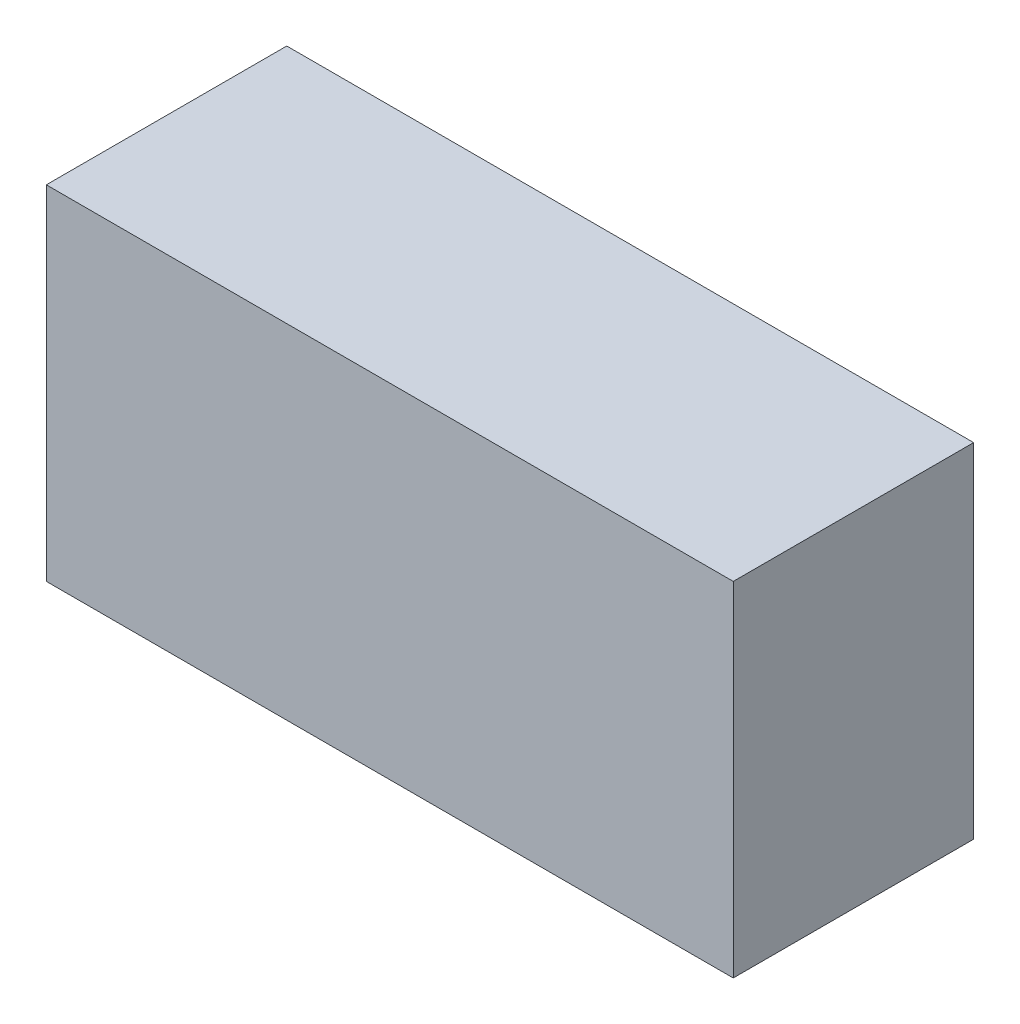
ISO-10303-21;
HEADER;
FILE_DESCRIPTION(('STEP AP214'),'2;1');
FILE_NAME('part.step','',(''),(''),'','','');
FILE_SCHEMA(('AUTOMOTIVE_DESIGN { 1 0 10303 214 1 1 1 1 }'));
ENDSEC;
DATA;
#1=APPLICATION_CONTEXT('core data for automotive mechanical design processes');
#2=APPLICATION_PROTOCOL_DEFINITION('international standard','automotive_design',2000,#1);
#3=PRODUCT_CONTEXT('',#1,'mechanical');
#4=PRODUCT('Part','Part','',(#3));
#5=PRODUCT_RELATED_PRODUCT_CATEGORY('part','',(#4));
#6=PRODUCT_DEFINITION_FORMATION('','',#4);
#7=PRODUCT_DEFINITION_CONTEXT('part definition',#1,'design');
#8=PRODUCT_DEFINITION('design','',#6,#7);
#9=PRODUCT_DEFINITION_SHAPE('','',#8);
#10=(LENGTH_UNIT() NAMED_UNIT(*) SI_UNIT(.MILLI.,.METRE.));
#11=(NAMED_UNIT(*) PLANE_ANGLE_UNIT() SI_UNIT($,.RADIAN.));
#12=(NAMED_UNIT(*) SI_UNIT($,.STERADIAN.) SOLID_ANGLE_UNIT());
#13=UNCERTAINTY_MEASURE_WITH_UNIT(LENGTH_MEASURE(1.E-05),#10,'distance_accuracy_value','');
#14=(GEOMETRIC_REPRESENTATION_CONTEXT(3) GLOBAL_UNCERTAINTY_ASSIGNED_CONTEXT((#13)) GLOBAL_UNIT_ASSIGNED_CONTEXT((#10,
#11,#12)) REPRESENTATION_CONTEXT('',''));
#15=CARTESIAN_POINT('',(0.,0.,0.));
#16=DIRECTION('',(0.,0.,1.));
#17=DIRECTION('',(1.,0.,0.));
#18=AXIS2_PLACEMENT_3D('',#15,#16,#17);
#19=CARTESIAN_POINT('',(-500.,500.,175.));
#20=DIRECTION('',(0.,0.,-1.));
#21=DIRECTION('',(-1.,0.,0.));
#22=AXIS2_PLACEMENT_3D('',#19,#20,#21);
#23=PLANE('',#22);
#24=DIRECTION('',(1.,0.,0.));
#25=VECTOR('',#24,1.);
#26=CARTESIAN_POINT('',(-500.,0.,175.));
#27=LINE('',#26,#25);
#28=CARTESIAN_POINT('',(-500.,0.,175.));
#29=VERTEX_POINT('',#28);
#30=CARTESIAN_POINT('',(500.,0.,175.));
#31=VERTEX_POINT('',#30);
#32=EDGE_CURVE('E95',#29,#31,#27,.T.);
#33=ORIENTED_EDGE('',*,*,#32,.T.);
#34=DIRECTION('',(0.,-1.,0.));
#35=VECTOR('',#34,1.);
#36=CARTESIAN_POINT('',(500.,500.,175.));
#37=LINE('',#36,#35);
#38=CARTESIAN_POINT('',(500.,500.,175.));
#39=VERTEX_POINT('',#38);
#40=EDGE_CURVE('E11',#39,#31,#37,.T.);
#41=ORIENTED_EDGE('',*,*,#40,.F.);
#42=DIRECTION('',(1.,0.,0.));
#43=VECTOR('',#42,1.);
#44=CARTESIAN_POINT('',(-500.,500.,175.));
#45=LINE('',#44,#43);
#46=CARTESIAN_POINT('',(-500.,500.,175.));
#47=VERTEX_POINT('',#46);
#48=EDGE_CURVE('E72',#47,#39,#45,.T.);
#49=ORIENTED_EDGE('',*,*,#48,.F.);
#50=DIRECTION('',(0.,-1.,0.));
#51=VECTOR('',#50,1.);
#52=CARTESIAN_POINT('',(-500.,500.,175.));
#53=LINE('',#52,#51);
#54=EDGE_CURVE('E91',#47,#29,#53,.T.);
#55=ORIENTED_EDGE('',*,*,#54,.T.);
#56=EDGE_LOOP('',(#33,#41,#49,#55));
#57=FACE_BOUND('',#56,.T.);
#58=ADVANCED_FACE('F33',(#57),#23,.F.);
#59=CARTESIAN_POINT('',(500.,500.,-175.));
#60=DIRECTION('',(1.,0.,0.));
#61=DIRECTION('',(0.,0.,-1.));
#62=AXIS2_PLACEMENT_3D('',#59,#60,#61);
#63=PLANE('',#62);
#64=DIRECTION('',(0.,0.,1.));
#65=VECTOR('',#64,1.);
#66=CARTESIAN_POINT('',(500.,0.,-175.));
#67=LINE('',#66,#65);
#68=CARTESIAN_POINT('',(500.,0.,-175.));
#69=VERTEX_POINT('',#68);
#70=EDGE_CURVE('E81',#69,#31,#67,.T.);
#71=ORIENTED_EDGE('',*,*,#70,.F.);
#72=DIRECTION('',(0.,-1.,0.));
#73=VECTOR('',#72,1.);
#74=CARTESIAN_POINT('',(500.,500.,-175.));
#75=LINE('',#74,#73);
#76=CARTESIAN_POINT('',(500.,500.,-175.));
#77=VERTEX_POINT('',#76);
#78=EDGE_CURVE('E41',#77,#69,#75,.T.);
#79=ORIENTED_EDGE('',*,*,#78,.F.);
#80=DIRECTION('',(0.,0.,1.));
#81=VECTOR('',#80,1.);
#82=CARTESIAN_POINT('',(500.,500.,-175.));
#83=LINE('',#82,#81);
#84=EDGE_CURVE('E79',#77,#39,#83,.T.);
#85=ORIENTED_EDGE('',*,*,#84,.T.);
#86=ORIENTED_EDGE('',*,*,#40,.T.);
#87=EDGE_LOOP('',(#71,#79,#85,#86));
#88=FACE_BOUND('',#87,.T.);
#89=ADVANCED_FACE('F78',(#88),#63,.T.);
#90=CARTESIAN_POINT('',(-500.,500.,-175.));
#91=DIRECTION('',(0.,0.,-1.));
#92=DIRECTION('',(-1.,0.,0.));
#93=AXIS2_PLACEMENT_3D('',#90,#91,#92);
#94=PLANE('',#93);
#95=DIRECTION('',(1.,0.,0.));
#96=VECTOR('',#95,1.);
#97=CARTESIAN_POINT('',(-500.,0.,-175.));
#98=LINE('',#97,#96);
#99=CARTESIAN_POINT('',(-500.,0.,-175.));
#100=VERTEX_POINT('',#99);
#101=EDGE_CURVE('E99',#100,#69,#98,.T.);
#102=ORIENTED_EDGE('',*,*,#101,.F.);
#103=DIRECTION('',(0.,-1.,0.));
#104=VECTOR('',#103,1.);
#105=CARTESIAN_POINT('',(-500.,500.,-175.));
#106=LINE('',#105,#104);
#107=CARTESIAN_POINT('',(-500.,500.,-175.));
#108=VERTEX_POINT('',#107);
#109=EDGE_CURVE('E64',#108,#100,#106,.T.);
#110=ORIENTED_EDGE('',*,*,#109,.F.);
#111=DIRECTION('',(1.,0.,0.));
#112=VECTOR('',#111,1.);
#113=CARTESIAN_POINT('',(-500.,500.,-175.));
#114=LINE('',#113,#112);
#115=EDGE_CURVE('E87',#108,#77,#114,.T.);
#116=ORIENTED_EDGE('',*,*,#115,.T.);
#117=ORIENTED_EDGE('',*,*,#78,.T.);
#118=EDGE_LOOP('',(#102,#110,#116,#117));
#119=FACE_BOUND('',#118,.T.);
#120=ADVANCED_FACE('F89',(#119),#94,.T.);
#121=CARTESIAN_POINT('',(-500.,500.,-175.));
#122=DIRECTION('',(1.,0.,0.));
#123=DIRECTION('',(0.,0.,-1.));
#124=AXIS2_PLACEMENT_3D('',#121,#122,#123);
#125=PLANE('',#124);
#126=DIRECTION('',(0.,0.,1.));
#127=VECTOR('',#126,1.);
#128=CARTESIAN_POINT('',(-500.,0.,-175.));
#129=LINE('',#128,#127);
#130=EDGE_CURVE('E67',#100,#29,#129,.T.);
#131=ORIENTED_EDGE('',*,*,#130,.T.);
#132=ORIENTED_EDGE('',*,*,#54,.F.);
#133=DIRECTION('',(0.,0.,1.));
#134=VECTOR('',#133,1.);
#135=CARTESIAN_POINT('',(-500.,500.,-175.));
#136=LINE('',#135,#134);
#137=EDGE_CURVE('E49',#108,#47,#136,.T.);
#138=ORIENTED_EDGE('',*,*,#137,.F.);
#139=ORIENTED_EDGE('',*,*,#109,.T.);
#140=EDGE_LOOP('',(#131,#132,#138,#139));
#141=FACE_BOUND('',#140,.T.);
#142=ADVANCED_FACE('F112',(#141),#125,.F.);
#143=CARTESIAN_POINT('',(0.,500.,0.));
#144=DIRECTION('',(0.,-1.,0.));
#145=DIRECTION('',(0.,0.,-1.));
#146=AXIS2_PLACEMENT_3D('',#143,#144,#145);
#147=PLANE('',#146);
#148=ORIENTED_EDGE('',*,*,#48,.T.);
#149=ORIENTED_EDGE('',*,*,#84,.F.);
#150=ORIENTED_EDGE('',*,*,#115,.F.);
#151=ORIENTED_EDGE('',*,*,#137,.T.);
#152=EDGE_LOOP('',(#148,#149,#150,#151));
#153=FACE_BOUND('',#152,.T.);
#154=ADVANCED_FACE('F86',(#153),#147,.F.);
#155=CARTESIAN_POINT('',(0.,0.,0.));
#156=DIRECTION('',(0.,-1.,0.));
#157=DIRECTION('',(0.,0.,-1.));
#158=AXIS2_PLACEMENT_3D('',#155,#156,#157);
#159=PLANE('',#158);
#160=ORIENTED_EDGE('',*,*,#32,.F.);
#161=ORIENTED_EDGE('',*,*,#130,.F.);
#162=ORIENTED_EDGE('',*,*,#101,.T.);
#163=ORIENTED_EDGE('',*,*,#70,.T.);
#164=EDGE_LOOP('',(#160,#161,#162,#163));
#165=FACE_BOUND('',#164,.T.);
#166=ADVANCED_FACE('F106',(#165),#159,.T.);
#167=CLOSED_SHELL('',(#58,#89,#120,#142,#154,#166));
#168=MANIFOLD_SOLID_BREP('B2',#167);
#169=ADVANCED_BREP_SHAPE_REPRESENTATION('',(#18,#168),#14);
#170=SHAPE_DEFINITION_REPRESENTATION(#9,#169);
ENDSEC;
END-ISO-10303-21;
